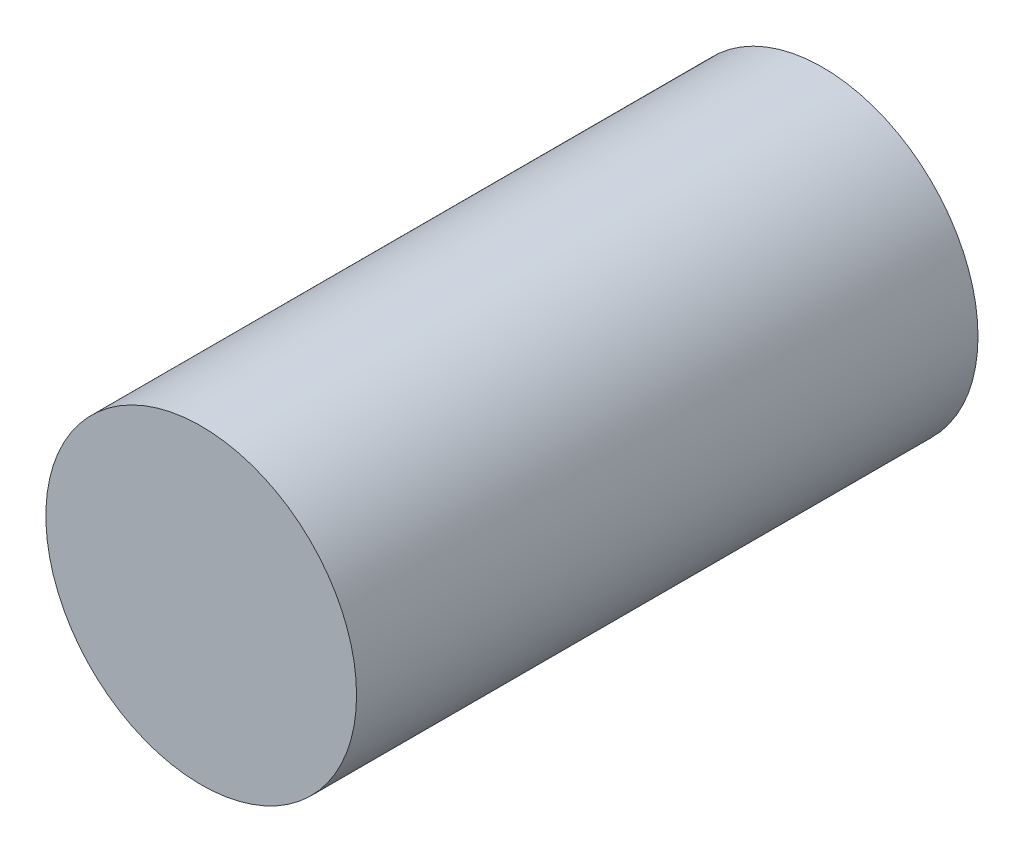
ISO-10303-21;
HEADER;
FILE_DESCRIPTION(('STEP AP214'),'2;1');
FILE_NAME('part.step','',(''),(''),'','','');
FILE_SCHEMA(('AUTOMOTIVE_DESIGN { 1 0 10303 214 1 1 1 1 }'));
ENDSEC;
DATA;
#1=APPLICATION_CONTEXT('core data for automotive mechanical design processes');
#2=APPLICATION_PROTOCOL_DEFINITION('international standard','automotive_design',2000,#1);
#3=PRODUCT_CONTEXT('',#1,'mechanical');
#4=PRODUCT('Part','Part','',(#3));
#5=PRODUCT_RELATED_PRODUCT_CATEGORY('part','',(#4));
#6=PRODUCT_DEFINITION_FORMATION('','',#4);
#7=PRODUCT_DEFINITION_CONTEXT('part definition',#1,'design');
#8=PRODUCT_DEFINITION('design','',#6,#7);
#9=PRODUCT_DEFINITION_SHAPE('','',#8);
#10=(LENGTH_UNIT() NAMED_UNIT(*) SI_UNIT(.MILLI.,.METRE.));
#11=(NAMED_UNIT(*) PLANE_ANGLE_UNIT() SI_UNIT($,.RADIAN.));
#12=(NAMED_UNIT(*) SI_UNIT($,.STERADIAN.) SOLID_ANGLE_UNIT());
#13=UNCERTAINTY_MEASURE_WITH_UNIT(LENGTH_MEASURE(1.E-05),#10,'distance_accuracy_value','');
#14=(GEOMETRIC_REPRESENTATION_CONTEXT(3) GLOBAL_UNCERTAINTY_ASSIGNED_CONTEXT((#13)) GLOBAL_UNIT_ASSIGNED_CONTEXT((#10,
#11,#12)) REPRESENTATION_CONTEXT('',''));
#15=CARTESIAN_POINT('',(0.,0.,0.));
#16=DIRECTION('',(0.,0.,1.));
#17=DIRECTION('',(1.,0.,0.));
#18=AXIS2_PLACEMENT_3D('',#15,#16,#17);
#19=CARTESIAN_POINT('',(0.,0.,1.));
#20=DIRECTION('',(0.,0.,-1.));
#21=DIRECTION('',(-1.,0.,0.));
#22=AXIS2_PLACEMENT_3D('',#19,#20,#21);
#23=CYLINDRICAL_SURFACE('',#22,0.25);
#24=CARTESIAN_POINT('',(0.,0.,1.));
#25=DIRECTION('',(0.,0.,1.));
#26=DIRECTION('',(1.,0.,0.));
#27=AXIS2_PLACEMENT_3D('',#24,#25,#26);
#28=CIRCLE('',#27,0.25);
#29=CARTESIAN_POINT('',(0.25,0.,1.));
#30=VERTEX_POINT('',#29);
#31=EDGE_CURVE('E10',#30,#30,#28,.T.);
#32=ORIENTED_EDGE('',*,*,#31,.F.);
#33=EDGE_LOOP('',(#32));
#34=FACE_BOUND('',#33,.T.);
#35=CARTESIAN_POINT('',(0.,0.,0.));
#36=DIRECTION('',(0.,0.,1.));
#37=DIRECTION('',(1.,0.,0.));
#38=AXIS2_PLACEMENT_3D('',#35,#36,#37);
#39=CIRCLE('',#38,0.25);
#40=CARTESIAN_POINT('',(0.25,0.,0.));
#41=VERTEX_POINT('',#40);
#42=EDGE_CURVE('E37',#41,#41,#39,.T.);
#43=ORIENTED_EDGE('',*,*,#42,.T.);
#44=EDGE_LOOP('',(#43));
#45=FACE_BOUND('',#44,.T.);
#46=ADVANCED_FACE('F34',(#34,#45),#23,.T.);
#47=CARTESIAN_POINT('',(0.,0.,1.));
#48=DIRECTION('',(0.,0.,1.));
#49=DIRECTION('',(1.,0.,0.));
#50=AXIS2_PLACEMENT_3D('',#47,#48,#49);
#51=PLANE('',#50);
#52=ORIENTED_EDGE('',*,*,#31,.T.);
#53=EDGE_LOOP('',(#52));
#54=FACE_BOUND('',#53,.T.);
#55=ADVANCED_FACE('F49',(#54),#51,.T.);
#56=CARTESIAN_POINT('',(0.,0.,0.));
#57=DIRECTION('',(0.,0.,1.));
#58=DIRECTION('',(1.,0.,0.));
#59=AXIS2_PLACEMENT_3D('',#56,#57,#58);
#60=PLANE('',#59);
#61=ORIENTED_EDGE('',*,*,#42,.F.);
#62=EDGE_LOOP('',(#61));
#63=FACE_BOUND('',#62,.T.);
#64=ADVANCED_FACE('F47',(#63),#60,.F.);
#65=CLOSED_SHELL('',(#46,#55,#64));
#66=MANIFOLD_SOLID_BREP('B2',#65);
#67=ADVANCED_BREP_SHAPE_REPRESENTATION('',(#18,#66),#14);
#68=SHAPE_DEFINITION_REPRESENTATION(#9,#67);
ENDSEC;
END-ISO-10303-21;
